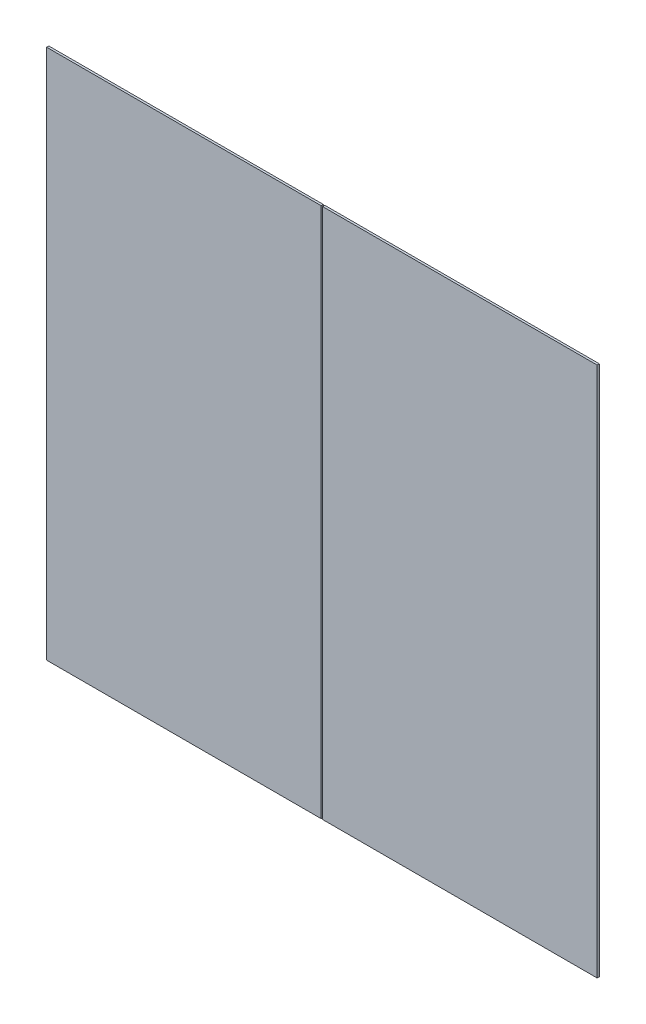
ISO-10303-21;
HEADER;
FILE_DESCRIPTION(('STEP AP214'),'2;1');
FILE_NAME('part.step','',(''),(''),'','','');
FILE_SCHEMA(('AUTOMOTIVE_DESIGN { 1 0 10303 214 1 1 1 1 }'));
ENDSEC;
DATA;
#1=APPLICATION_CONTEXT('core data for automotive mechanical design processes');
#2=APPLICATION_PROTOCOL_DEFINITION('international standard','automotive_design',2000,#1);
#3=PRODUCT_CONTEXT('',#1,'mechanical');
#4=PRODUCT('Part','Part','',(#3));
#5=PRODUCT_RELATED_PRODUCT_CATEGORY('part','',(#4));
#6=PRODUCT_DEFINITION_FORMATION('','',#4);
#7=PRODUCT_DEFINITION_CONTEXT('part definition',#1,'design');
#8=PRODUCT_DEFINITION('design','',#6,#7);
#9=PRODUCT_DEFINITION_SHAPE('','',#8);
#10=(LENGTH_UNIT() NAMED_UNIT(*) SI_UNIT(.MILLI.,.METRE.));
#11=(NAMED_UNIT(*) PLANE_ANGLE_UNIT() SI_UNIT($,.RADIAN.));
#12=(NAMED_UNIT(*) SI_UNIT($,.STERADIAN.) SOLID_ANGLE_UNIT());
#13=UNCERTAINTY_MEASURE_WITH_UNIT(LENGTH_MEASURE(1.E-05),#10,'distance_accuracy_value','');
#14=(GEOMETRIC_REPRESENTATION_CONTEXT(3) GLOBAL_UNCERTAINTY_ASSIGNED_CONTEXT((#13)) GLOBAL_UNIT_ASSIGNED_CONTEXT((#10,
#11,#12)) REPRESENTATION_CONTEXT('',''));
#15=CARTESIAN_POINT('',(0.,0.,0.));
#16=DIRECTION('',(0.,0.,1.));
#17=DIRECTION('',(1.,0.,0.));
#18=AXIS2_PLACEMENT_3D('',#15,#16,#17);
#19=CARTESIAN_POINT('',(3.17500000000029,-1166.114,9.525));
#20=DIRECTION('',(0.,1.,0.));
#21=DIRECTION('',(0.,0.,1.));
#22=AXIS2_PLACEMENT_3D('',#19,#20,#21);
#23=PLANE('',#22);
#24=DIRECTION('',(1.,0.,0.));
#25=VECTOR('',#24,1.);
#26=CARTESIAN_POINT('',(3.17500000000029,-1166.114,0.));
#27=LINE('',#26,#25);
#28=CARTESIAN_POINT('',(3.17500000000029,-1166.114,0.));
#29=VERTEX_POINT('',#28);
#30=CARTESIAN_POINT('',(1209.04,-1166.114,0.));
#31=VERTEX_POINT('',#30);
#32=EDGE_CURVE('E107',#29,#31,#27,.T.);
#33=ORIENTED_EDGE('',*,*,#32,.T.);
#34=DIRECTION('',(0.,0.,-1.));
#35=VECTOR('',#34,1.);
#36=CARTESIAN_POINT('',(1209.04,-1166.114,9.525));
#37=LINE('',#36,#35);
#38=CARTESIAN_POINT('',(1209.04,-1166.114,9.525));
#39=VERTEX_POINT('',#38);
#40=EDGE_CURVE('E12',#39,#31,#37,.T.);
#41=ORIENTED_EDGE('',*,*,#40,.F.);
#42=DIRECTION('',(1.,0.,0.));
#43=VECTOR('',#42,1.);
#44=CARTESIAN_POINT('',(3.17500000000029,-1166.114,9.525));
#45=LINE('',#44,#43);
#46=CARTESIAN_POINT('',(3.17500000000029,-1166.114,9.525));
#47=VERTEX_POINT('',#46);
#48=EDGE_CURVE('E95',#47,#39,#45,.T.);
#49=ORIENTED_EDGE('',*,*,#48,.F.);
#50=DIRECTION('',(0.,0.,-1.));
#51=VECTOR('',#50,1.);
#52=CARTESIAN_POINT('',(3.17500000000029,-1166.114,9.525));
#53=LINE('',#52,#51);
#54=EDGE_CURVE('E103',#47,#29,#53,.T.);
#55=ORIENTED_EDGE('',*,*,#54,.T.);
#56=EDGE_LOOP('',(#33,#41,#49,#55));
#57=FACE_BOUND('',#56,.T.);
#58=ADVANCED_FACE('F44',(#57),#23,.F.);
#59=CARTESIAN_POINT('',(1209.04,1166.114,9.525));
#60=DIRECTION('',(-1.,0.,0.));
#61=DIRECTION('',(0.,0.,1.));
#62=AXIS2_PLACEMENT_3D('',#59,#60,#61);
#63=PLANE('',#62);
#64=DIRECTION('',(0.,1.,0.));
#65=VECTOR('',#64,1.);
#66=CARTESIAN_POINT('',(1209.04,1166.114,0.));
#67=LINE('',#66,#65);
#68=CARTESIAN_POINT('',(1209.04,1166.114,0.));
#69=VERTEX_POINT('',#68);
#70=EDGE_CURVE('E99',#31,#69,#67,.T.);
#71=ORIENTED_EDGE('',*,*,#70,.T.);
#72=DIRECTION('',(0.,0.,-1.));
#73=VECTOR('',#72,1.);
#74=CARTESIAN_POINT('',(1209.04,1166.114,9.525));
#75=LINE('',#74,#73);
#76=CARTESIAN_POINT('',(1209.04,1166.114,9.525));
#77=VERTEX_POINT('',#76);
#78=EDGE_CURVE('E52',#77,#69,#75,.T.);
#79=ORIENTED_EDGE('',*,*,#78,.F.);
#80=DIRECTION('',(0.,1.,0.));
#81=VECTOR('',#80,1.);
#82=CARTESIAN_POINT('',(1209.04,1166.114,9.525));
#83=LINE('',#82,#81);
#84=EDGE_CURVE('E90',#39,#77,#83,.T.);
#85=ORIENTED_EDGE('',*,*,#84,.F.);
#86=ORIENTED_EDGE('',*,*,#40,.T.);
#87=EDGE_LOOP('',(#71,#79,#85,#86));
#88=FACE_BOUND('',#87,.T.);
#89=ADVANCED_FACE('F98',(#88),#63,.F.);
#90=CARTESIAN_POINT('',(3.17500000000029,1166.114,9.525));
#91=DIRECTION('',(0.,-1.,0.));
#92=DIRECTION('',(0.,0.,-1.));
#93=AXIS2_PLACEMENT_3D('',#90,#91,#92);
#94=PLANE('',#93);
#95=DIRECTION('',(-1.,0.,0.));
#96=VECTOR('',#95,1.);
#97=CARTESIAN_POINT('',(3.17500000000029,1166.114,0.));
#98=LINE('',#97,#96);
#99=CARTESIAN_POINT('',(3.17500000000029,1166.114,0.));
#100=VERTEX_POINT('',#99);
#101=EDGE_CURVE('E77',#69,#100,#98,.T.);
#102=ORIENTED_EDGE('',*,*,#101,.T.);
#103=DIRECTION('',(0.,0.,-1.));
#104=VECTOR('',#103,1.);
#105=CARTESIAN_POINT('',(3.17500000000029,1166.114,9.525));
#106=LINE('',#105,#104);
#107=CARTESIAN_POINT('',(3.17500000000029,1166.114,9.525));
#108=VERTEX_POINT('',#107);
#109=EDGE_CURVE('E100',#108,#100,#106,.T.);
#110=ORIENTED_EDGE('',*,*,#109,.F.);
#111=DIRECTION('',(-1.,0.,0.));
#112=VECTOR('',#111,1.);
#113=CARTESIAN_POINT('',(3.17500000000029,1166.114,9.525));
#114=LINE('',#113,#112);
#115=EDGE_CURVE('E93',#77,#108,#114,.T.);
#116=ORIENTED_EDGE('',*,*,#115,.F.);
#117=ORIENTED_EDGE('',*,*,#78,.T.);
#118=EDGE_LOOP('',(#102,#110,#116,#117));
#119=FACE_BOUND('',#118,.T.);
#120=ADVANCED_FACE('F101',(#119),#94,.F.);
#121=CARTESIAN_POINT('',(3.17500000000029,-1166.114,9.525));
#122=DIRECTION('',(1.,0.,0.));
#123=DIRECTION('',(0.,0.,-1.));
#124=AXIS2_PLACEMENT_3D('',#121,#122,#123);
#125=PLANE('',#124);
#126=DIRECTION('',(0.,-1.,0.));
#127=VECTOR('',#126,1.);
#128=CARTESIAN_POINT('',(3.17500000000029,-1166.114,0.));
#129=LINE('',#128,#127);
#130=EDGE_CURVE('E83',#100,#29,#129,.T.);
#131=ORIENTED_EDGE('',*,*,#130,.T.);
#132=ORIENTED_EDGE('',*,*,#54,.F.);
#133=DIRECTION('',(0.,-1.,0.));
#134=VECTOR('',#133,1.);
#135=CARTESIAN_POINT('',(3.17500000000029,-1166.114,9.525));
#136=LINE('',#135,#134);
#137=EDGE_CURVE('E60',#108,#47,#136,.T.);
#138=ORIENTED_EDGE('',*,*,#137,.F.);
#139=ORIENTED_EDGE('',*,*,#109,.T.);
#140=EDGE_LOOP('',(#131,#132,#138,#139));
#141=FACE_BOUND('',#140,.T.);
#142=ADVANCED_FACE('F114',(#141),#125,.F.);
#143=CARTESIAN_POINT('',(0.,0.,9.525));
#144=DIRECTION('',(0.,0.,-1.));
#145=DIRECTION('',(-1.,0.,0.));
#146=AXIS2_PLACEMENT_3D('',#143,#144,#145);
#147=PLANE('',#146);
#148=ORIENTED_EDGE('',*,*,#48,.T.);
#149=ORIENTED_EDGE('',*,*,#84,.T.);
#150=ORIENTED_EDGE('',*,*,#115,.T.);
#151=ORIENTED_EDGE('',*,*,#137,.T.);
#152=EDGE_LOOP('',(#148,#149,#150,#151));
#153=FACE_BOUND('',#152,.T.);
#154=ADVANCED_FACE('F91',(#153),#147,.F.);
#155=CARTESIAN_POINT('',(0.,0.,0.));
#156=DIRECTION('',(0.,0.,-1.));
#157=DIRECTION('',(-1.,0.,0.));
#158=AXIS2_PLACEMENT_3D('',#155,#156,#157);
#159=PLANE('',#158);
#160=ORIENTED_EDGE('',*,*,#32,.F.);
#161=ORIENTED_EDGE('',*,*,#130,.F.);
#162=ORIENTED_EDGE('',*,*,#101,.F.);
#163=ORIENTED_EDGE('',*,*,#70,.F.);
#164=EDGE_LOOP('',(#160,#161,#162,#163));
#165=FACE_BOUND('',#164,.T.);
#166=ADVANCED_FACE('F117',(#165),#159,.T.);
#167=CLOSED_SHELL('',(#58,#89,#120,#142,#154,#166));
#168=MANIFOLD_SOLID_BREP('B2',#167);
#169=CARTESIAN_POINT('',(-1209.04,1166.114,9.525));
#170=DIRECTION('',(1.,0.,0.));
#171=DIRECTION('',(0.,0.,-1.));
#172=AXIS2_PLACEMENT_3D('',#169,#170,#171);
#173=PLANE('',#172);
#174=DIRECTION('',(0.,-1.,0.));
#175=VECTOR('',#174,1.);
#176=CARTESIAN_POINT('',(-1209.04,1166.114,0.));
#177=LINE('',#176,#175);
#178=CARTESIAN_POINT('',(-1209.04,1166.114,0.));
#179=VERTEX_POINT('',#178);
#180=CARTESIAN_POINT('',(-1209.04,-1166.114,0.));
#181=VERTEX_POINT('',#180);
#182=EDGE_CURVE('E230',#179,#181,#177,.T.);
#183=ORIENTED_EDGE('',*,*,#182,.T.);
#184=DIRECTION('',(0.,0.,-1.));
#185=VECTOR('',#184,1.);
#186=CARTESIAN_POINT('',(-1209.04,-1166.114,9.525));
#187=LINE('',#186,#185);
#188=CARTESIAN_POINT('',(-1209.04,-1166.114,9.525));
#189=VERTEX_POINT('',#188);
#190=EDGE_CURVE('E42',#189,#181,#187,.T.);
#191=ORIENTED_EDGE('',*,*,#190,.F.);
#192=DIRECTION('',(0.,-1.,0.));
#193=VECTOR('',#192,1.);
#194=CARTESIAN_POINT('',(-1209.04,1166.114,9.525));
#195=LINE('',#194,#193);
#196=CARTESIAN_POINT('',(-1209.04,1166.114,9.525));
#197=VERTEX_POINT('',#196);
#198=EDGE_CURVE('E218',#197,#189,#195,.T.);
#199=ORIENTED_EDGE('',*,*,#198,.F.);
#200=DIRECTION('',(0.,0.,-1.));
#201=VECTOR('',#200,1.);
#202=CARTESIAN_POINT('',(-1209.04,1166.114,9.525));
#203=LINE('',#202,#201);
#204=EDGE_CURVE('E226',#197,#179,#203,.T.);
#205=ORIENTED_EDGE('',*,*,#204,.T.);
#206=EDGE_LOOP('',(#183,#191,#199,#205));
#207=FACE_BOUND('',#206,.T.);
#208=ADVANCED_FACE('F167',(#207),#173,.F.);
#209=CARTESIAN_POINT('',(-1209.04,-1166.114,9.525));
#210=DIRECTION('',(0.,1.,0.));
#211=DIRECTION('',(0.,0.,1.));
#212=AXIS2_PLACEMENT_3D('',#209,#210,#211);
#213=PLANE('',#212);
#214=DIRECTION('',(1.,0.,0.));
#215=VECTOR('',#214,1.);
#216=CARTESIAN_POINT('',(-1209.04,-1166.114,0.));
#217=LINE('',#216,#215);
#218=CARTESIAN_POINT('',(-3.17499999999943,-1166.114,0.));
#219=VERTEX_POINT('',#218);
#220=EDGE_CURVE('E222',#181,#219,#217,.T.);
#221=ORIENTED_EDGE('',*,*,#220,.T.);
#222=DIRECTION('',(0.,0.,-1.));
#223=VECTOR('',#222,1.);
#224=CARTESIAN_POINT('',(-3.17499999999943,-1166.114,9.525));
#225=LINE('',#224,#223);
#226=CARTESIAN_POINT('',(-3.17499999999943,-1166.114,9.525));
#227=VERTEX_POINT('',#226);
#228=EDGE_CURVE('E175',#227,#219,#225,.T.);
#229=ORIENTED_EDGE('',*,*,#228,.F.);
#230=DIRECTION('',(1.,0.,0.));
#231=VECTOR('',#230,1.);
#232=CARTESIAN_POINT('',(-1209.04,-1166.114,9.525));
#233=LINE('',#232,#231);
#234=EDGE_CURVE('E213',#189,#227,#233,.T.);
#235=ORIENTED_EDGE('',*,*,#234,.F.);
#236=ORIENTED_EDGE('',*,*,#190,.T.);
#237=EDGE_LOOP('',(#221,#229,#235,#236));
#238=FACE_BOUND('',#237,.T.);
#239=ADVANCED_FACE('F221',(#238),#213,.F.);
#240=CARTESIAN_POINT('',(-3.17499999999943,1166.114,9.525));
#241=DIRECTION('',(-1.,0.,0.));
#242=DIRECTION('',(0.,0.,1.));
#243=AXIS2_PLACEMENT_3D('',#240,#241,#242);
#244=PLANE('',#243);
#245=DIRECTION('',(0.,1.,0.));
#246=VECTOR('',#245,1.);
#247=CARTESIAN_POINT('',(-3.17499999999943,1166.114,0.));
#248=LINE('',#247,#246);
#249=CARTESIAN_POINT('',(-3.17499999999943,1166.114,0.));
#250=VERTEX_POINT('',#249);
#251=EDGE_CURVE('E200',#219,#250,#248,.T.);
#252=ORIENTED_EDGE('',*,*,#251,.T.);
#253=DIRECTION('',(0.,0.,-1.));
#254=VECTOR('',#253,1.);
#255=CARTESIAN_POINT('',(-3.17499999999943,1166.114,9.525));
#256=LINE('',#255,#254);
#257=CARTESIAN_POINT('',(-3.17499999999943,1166.114,9.525));
#258=VERTEX_POINT('',#257);
#259=EDGE_CURVE('E223',#258,#250,#256,.T.);
#260=ORIENTED_EDGE('',*,*,#259,.F.);
#261=DIRECTION('',(0.,1.,0.));
#262=VECTOR('',#261,1.);
#263=CARTESIAN_POINT('',(-3.17499999999943,1166.114,9.525));
#264=LINE('',#263,#262);
#265=EDGE_CURVE('E216',#227,#258,#264,.T.);
#266=ORIENTED_EDGE('',*,*,#265,.F.);
#267=ORIENTED_EDGE('',*,*,#228,.T.);
#268=EDGE_LOOP('',(#252,#260,#266,#267));
#269=FACE_BOUND('',#268,.T.);
#270=ADVANCED_FACE('F224',(#269),#244,.F.);
#271=CARTESIAN_POINT('',(-1209.04,1166.114,9.525));
#272=DIRECTION('',(0.,-1.,0.));
#273=DIRECTION('',(0.,0.,-1.));
#274=AXIS2_PLACEMENT_3D('',#271,#272,#273);
#275=PLANE('',#274);
#276=DIRECTION('',(-1.,0.,0.));
#277=VECTOR('',#276,1.);
#278=CARTESIAN_POINT('',(-1209.04,1166.114,0.));
#279=LINE('',#278,#277);
#280=EDGE_CURVE('E206',#250,#179,#279,.T.);
#281=ORIENTED_EDGE('',*,*,#280,.T.);
#282=ORIENTED_EDGE('',*,*,#204,.F.);
#283=DIRECTION('',(-1.,0.,0.));
#284=VECTOR('',#283,1.);
#285=CARTESIAN_POINT('',(-1209.04,1166.114,9.525));
#286=LINE('',#285,#284);
#287=EDGE_CURVE('E183',#258,#197,#286,.T.);
#288=ORIENTED_EDGE('',*,*,#287,.F.);
#289=ORIENTED_EDGE('',*,*,#259,.T.);
#290=EDGE_LOOP('',(#281,#282,#288,#289));
#291=FACE_BOUND('',#290,.T.);
#292=ADVANCED_FACE('F237',(#291),#275,.F.);
#293=CARTESIAN_POINT('',(0.,0.,9.525));
#294=DIRECTION('',(0.,0.,1.));
#295=DIRECTION('',(1.,0.,0.));
#296=AXIS2_PLACEMENT_3D('',#293,#294,#295);
#297=PLANE('',#296);
#298=ORIENTED_EDGE('',*,*,#198,.T.);
#299=ORIENTED_EDGE('',*,*,#234,.T.);
#300=ORIENTED_EDGE('',*,*,#265,.T.);
#301=ORIENTED_EDGE('',*,*,#287,.T.);
#302=EDGE_LOOP('',(#298,#299,#300,#301));
#303=FACE_BOUND('',#302,.T.);
#304=ADVANCED_FACE('F214',(#303),#297,.T.);
#305=CARTESIAN_POINT('',(0.,0.,0.));
#306=DIRECTION('',(0.,0.,1.));
#307=DIRECTION('',(1.,0.,0.));
#308=AXIS2_PLACEMENT_3D('',#305,#306,#307);
#309=PLANE('',#308);
#310=ORIENTED_EDGE('',*,*,#182,.F.);
#311=ORIENTED_EDGE('',*,*,#280,.F.);
#312=ORIENTED_EDGE('',*,*,#251,.F.);
#313=ORIENTED_EDGE('',*,*,#220,.F.);
#314=EDGE_LOOP('',(#310,#311,#312,#313));
#315=FACE_BOUND('',#314,.T.);
#316=ADVANCED_FACE('F240',(#315),#309,.F.);
#317=CLOSED_SHELL('',(#208,#239,#270,#292,#304,#316));
#318=MANIFOLD_SOLID_BREP('B6',#317);
#319=ADVANCED_BREP_SHAPE_REPRESENTATION('',(#18,#168,#318),#14);
#320=SHAPE_DEFINITION_REPRESENTATION(#9,#319);
ENDSEC;
END-ISO-10303-21;
